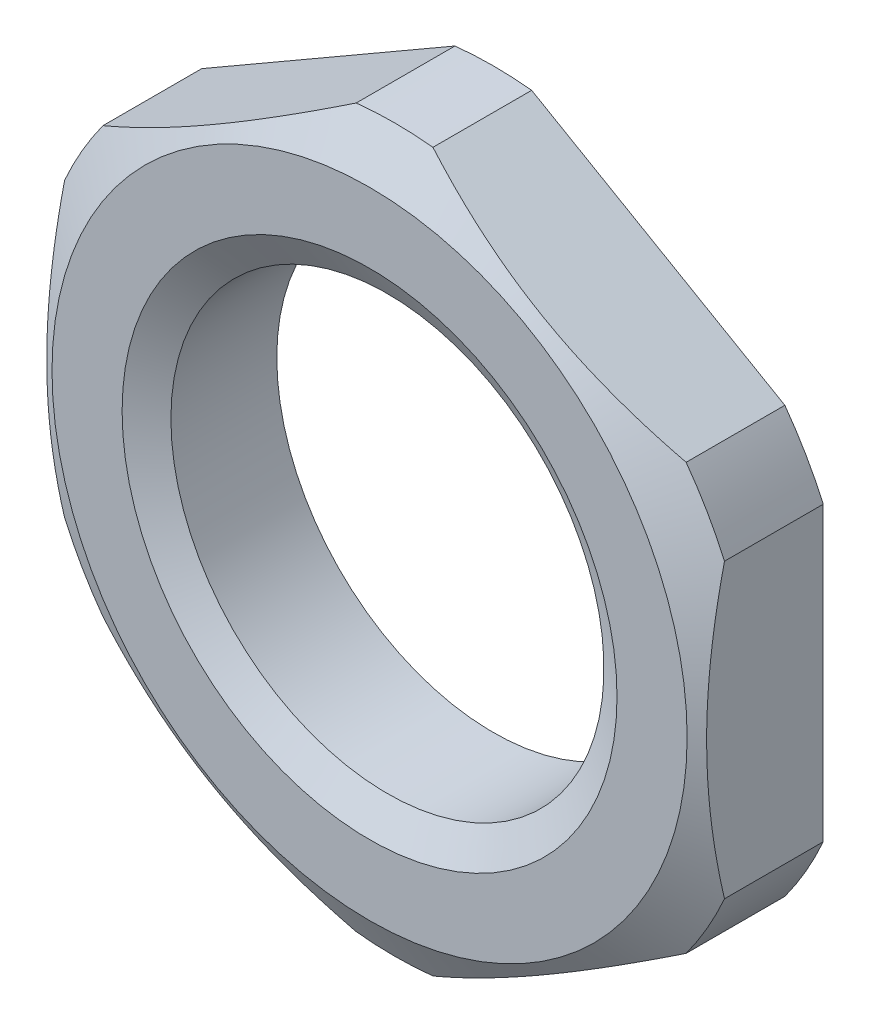
ISO-10303-21;
HEADER;
FILE_DESCRIPTION(('STEP AP214'),'2;1');
FILE_NAME('part.step','',(''),(''),'','','');
FILE_SCHEMA(('AUTOMOTIVE_DESIGN { 1 0 10303 214 1 1 1 1 }'));
ENDSEC;
DATA;
#1=APPLICATION_CONTEXT('core data for automotive mechanical design processes');
#2=APPLICATION_PROTOCOL_DEFINITION('international standard','automotive_design',2000,#1);
#3=PRODUCT_CONTEXT('',#1,'mechanical');
#4=PRODUCT('Part','Part','',(#3));
#5=PRODUCT_RELATED_PRODUCT_CATEGORY('part','',(#4));
#6=PRODUCT_DEFINITION_FORMATION('','',#4);
#7=PRODUCT_DEFINITION_CONTEXT('part definition',#1,'design');
#8=PRODUCT_DEFINITION('design','',#6,#7);
#9=PRODUCT_DEFINITION_SHAPE('','',#8);
#10=(LENGTH_UNIT() NAMED_UNIT(*) SI_UNIT(.MILLI.,.METRE.));
#11=(NAMED_UNIT(*) PLANE_ANGLE_UNIT() SI_UNIT($,.RADIAN.));
#12=(NAMED_UNIT(*) SI_UNIT($,.STERADIAN.) SOLID_ANGLE_UNIT());
#13=UNCERTAINTY_MEASURE_WITH_UNIT(LENGTH_MEASURE(1.E-05),#10,'distance_accuracy_value','');
#14=(GEOMETRIC_REPRESENTATION_CONTEXT(3) GLOBAL_UNCERTAINTY_ASSIGNED_CONTEXT((#13)) GLOBAL_UNIT_ASSIGNED_CONTEXT((#10,
#11,#12)) REPRESENTATION_CONTEXT('',''));
#15=CARTESIAN_POINT('',(0.,0.,0.));
#16=DIRECTION('',(0.,0.,1.));
#17=DIRECTION('',(1.,0.,0.));
#18=AXIS2_PLACEMENT_3D('',#15,#16,#17);
#19=CARTESIAN_POINT('',(0.,0.,0.));
#20=DIRECTION('',(0.,0.,-1.));
#21=DIRECTION('',(-1.,0.,0.));
#22=AXIS2_PLACEMENT_3D('',#19,#20,#21);
#23=CONICAL_SURFACE('',#22,7.7,1.0471975511966);
#24=CARTESIAN_POINT('',(0.,0.,-0.606217782649107));
#25=DIRECTION('',(0.,0.,-1.));
#26=DIRECTION('',(-1.,0.,0.));
#27=AXIS2_PLACEMENT_3D('',#24,#25,#26);
#28=CIRCLE('',#27,8.75);
#29=CARTESIAN_POINT('',(-0.930492710547831,8.70038409012024,-0.606217782649107));
#30=VERTEX_POINT('',#29);
#31=CARTESIAN_POINT('',(0.930492710547825,8.70038409012024,-0.606217782649107));
#32=VERTEX_POINT('',#31);
#33=EDGE_CURVE('E143',#30,#32,#28,.T.);
#34=ORIENTED_EDGE('',*,*,#33,.F.);
#35=CARTESIAN_POINT('',(-7.07024782767937,5.15559482048597,-0.606417782649106));
#36=CARTESIAN_POINT('',(-6.90148087906585,5.25303246369829,-0.560827597447312));
#37=CARTESIAN_POINT('',(-6.73208945777638,5.35083064637818,-0.518221370815185));
#38=CARTESIAN_POINT('',(-6.39211380389606,5.5471156816639,-0.439610585245916));
#39=CARTESIAN_POINT('',(-6.22152924144576,5.64560272471418,-0.403607933420928));
#40=CARTESIAN_POINT('',(-5.87914841907391,5.84327638467593,-0.33883245483654));
#41=CARTESIAN_POINT('',(-5.70735111111037,5.94246360667473,-0.310066952118132));
#42=CARTESIAN_POINT('',(-5.36291860488582,6.14132180686113,-0.260393822837285));
#43=CARTESIAN_POINT('',(-5.19028349106087,6.24099273629955,-0.239485420418063));
#44=CARTESIAN_POINT('',(-4.84766165540015,6.43880554534851,-0.206300910486343));
#45=CARTESIAN_POINT('',(-4.67768626969476,6.53694088004113,-0.193869681917507));
#46=CARTESIAN_POINT('',(-4.33743333679985,6.73338600244056,-0.177296510459336));
#47=CARTESIAN_POINT('',(-4.16715579495013,6.83169578706445,-0.173154422513488));
#48=CARTESIAN_POINT('',(-3.82672126187345,7.02824575637771,-0.173256640546117));
#49=CARTESIAN_POINT('',(-3.65656426928932,7.12648594185066,-0.177495107222737));
#50=CARTESIAN_POINT('',(-3.31657122626224,7.32278101676494,-0.194246464062967));
#51=CARTESIAN_POINT('',(-3.14673515244742,7.42083591970004,-0.206758726380949));
#52=CARTESIAN_POINT('',(-2.80564033024968,7.61776710711509,-0.239968908160903));
#53=CARTESIAN_POINT('',(-2.63438858443956,7.71663934865776,-0.260762108417526));
#54=CARTESIAN_POINT('',(-2.29272113587679,7.9139011420588,-0.310076759204187));
#55=CARTESIAN_POINT('',(-2.12230546023987,8.01229067826191,-0.338598458722785));
#56=CARTESIAN_POINT('',(-1.7808221079298,8.20944618364191,-0.4031222931993));
#57=CARTESIAN_POINT('',(-1.60976457436446,8.30820629669277,-0.439195422838334));
#58=CARTESIAN_POINT('',(-1.26884621332733,8.50503560420924,-0.517985988220957));
#59=CARTESIAN_POINT('',(-1.09898507401219,8.60310497871769,-0.560701620112898));
#60=CARTESIAN_POINT('',(-0.929752172319219,8.70081164006587,-0.606417782649489));
#61=B_SPLINE_CURVE_WITH_KNOTS('',3,(#35,#36,#37,#38,#39,#40,#41,#42,#43,#44,#45,#46,#47,#48,#49,
#50,#51,#52,#53,#54,#55,#56,#57,#58,#59,#60),.UNSPECIFIED.,.F.,.F.,(4,2,2,2,2,2,2,2,2,2,2,2,4),
(0.,0.600421078435158,1.20101528636273,1.80221487650076,2.40335508500863,2.99317671131804,
3.58298801590404,4.17238850369464,4.76174427076978,5.35808672461223,5.9544483930656,
6.55669108892153,7.15877052319375),.UNSPECIFIED.);
#62=CARTESIAN_POINT('',(-7.06950728945217,5.15602237043078,-0.606217782649107));
#63=VERTEX_POINT('',#62);
#64=EDGE_CURVE('E166',#63,#30,#61,.T.);
#65=ORIENTED_EDGE('',*,*,#64,.F.);
#66=CARTESIAN_POINT('',(-8.,3.54436171968946,-0.606217782649106));
#67=VERTEX_POINT('',#66);
#68=EDGE_CURVE('E141',#67,#63,#28,.T.);
#69=ORIENTED_EDGE('',*,*,#68,.F.);
#70=CARTESIAN_POINT('',(-8.,-13.8764766111287,-4.80204412448945));
#71=CARTESIAN_POINT('',(-8.,-13.5442874801191,-4.63591549315543));
#72=CARTESIAN_POINT('',(-8.,-13.2115180857593,-4.47093495417548));
#73=CARTESIAN_POINT('',(-8.,-12.5445543586188,-4.14382481794102));
#74=CARTESIAN_POINT('',(-8.,-12.2103599319763,-3.98169541220027));
#75=CARTESIAN_POINT('',(-8.,-11.5396499896447,-3.6605409337019));
#76=CARTESIAN_POINT('',(-8.,-11.2031311507491,-3.50152278649282));
#77=CARTESIAN_POINT('',(-8.,-10.5281391364751,-3.1876992829647));
#78=CARTESIAN_POINT('',(-8.,-10.1896659995691,-3.03289384405452));
#79=CARTESIAN_POINT('',(-8.,-9.49513378913338,-2.72163092055866));
#80=CARTESIAN_POINT('',(-8.,-9.13896765926432,-2.56541152721838));
#81=CARTESIAN_POINT('',(-8.,-8.42356960277638,-2.26008385836664));
#82=CARTESIAN_POINT('',(-8.,-8.06433753997261,-2.11097590069477));
#83=CARTESIAN_POINT('',(-8.,-7.34245687310797,-1.82188695772267));
#84=CARTESIAN_POINT('',(-8.,-6.97981053398933,-1.68190035111402));
#85=CARTESIAN_POINT('',(-8.,-6.25027969427314,-1.41349922902));
#86=CARTESIAN_POINT('',(-8.,-5.88339566322241,-1.28508344507549));
#87=CARTESIAN_POINT('',(-8.,-5.05797946165013,-1.01461876111247));
#88=CARTESIAN_POINT('',(-8.,-4.59815647589117,-0.876449351736542));
#89=CARTESIAN_POINT('',(-8.,-3.67022179574602,-0.630530687581275));
#90=CARTESIAN_POINT('',(-8.,-3.20211085723131,-0.522778673730966));
#91=CARTESIAN_POINT('',(-8.,-2.49841127585198,-0.391544954818452));
#92=CARTESIAN_POINT('',(-8.,-2.26559305282137,-0.353070102390249));
#93=CARTESIAN_POINT('',(-8.,-1.79843934275616,-0.286674133852241));
#94=CARTESIAN_POINT('',(-8.,-1.56410388226326,-0.258752833629062));
#95=CARTESIAN_POINT('',(-8.,-1.09442904610587,-0.214307703620745));
#96=CARTESIAN_POINT('',(-8.,-0.859090051533899,-0.197779878244263));
#97=CARTESIAN_POINT('',(-8.,-0.387872475907795,-0.176641903679802));
#98=CARTESIAN_POINT('',(-8.,-0.151993897100356,-0.172031704959875));
#99=CARTESIAN_POINT('',(-8.,0.321094555455518,-0.174894323794021));
#100=CARTESIAN_POINT('',(-8.,0.55830399113351,-0.182439269048492));
#101=CARTESIAN_POINT('',(-8.,1.03203312581689,-0.209490559349325));
#102=CARTESIAN_POINT('',(-8.,1.26855282175315,-0.228996957539015));
#103=CARTESIAN_POINT('',(-8.,1.74046266183219,-0.279350980375523));
#104=CARTESIAN_POINT('',(-8.,1.97585234427651,-0.310202897294681));
#105=CARTESIAN_POINT('',(-8.,2.44501424995313,-0.382340249104343));
#106=CARTESIAN_POINT('',(-8.,2.67878641627033,-0.423626049230286));
#107=CARTESIAN_POINT('',(-8.,3.38515478124549,-0.563105940856547));
#108=CARTESIAN_POINT('',(-8.,3.85486745607192,-0.676015200681886));
#109=CARTESIAN_POINT('',(-8.,4.7861771729947,-0.931483455454732));
#110=CARTESIAN_POINT('',(-8.,5.24776950158325,-1.0740590921215));
#111=CARTESIAN_POINT('',(-8.,6.06591729060817,-1.34835302184172));
#112=CARTESIAN_POINT('',(-8.,6.42388951791318,-1.47590773769571));
#113=CARTESIAN_POINT('',(-8.,7.13574301584211,-1.7416227189199));
#114=CARTESIAN_POINT('',(-8.,7.48962538091356,-1.87978006769539));
#115=CARTESIAN_POINT('',(-8.,8.19422740347913,-2.16454843047428));
#116=CARTESIAN_POINT('',(-8.,8.54494479460472,-2.31116502025219));
#117=CARTESIAN_POINT('',(-8.,9.24354242340729,-2.61104347450411));
#118=CARTESIAN_POINT('',(-8.,9.59142248377611,-2.76430575055151));
#119=CARTESIAN_POINT('',(-8.,10.2701619396937,-3.06956319456063));
#120=CARTESIAN_POINT('',(-8.,10.601120267001,-3.22133906763949));
#121=CARTESIAN_POINT('',(-8.,11.2611758690625,-3.52886476718296));
#122=CARTESIAN_POINT('',(-8.,11.5902731725835,-3.68461453201461));
#123=CARTESIAN_POINT('',(-8.,12.2463188455876,-3.99910327985798));
#124=CARTESIAN_POINT('',(-8.,12.5732699832054,-4.15783649998909));
#125=CARTESIAN_POINT('',(-8.,13.2258250119478,-4.47802750792386));
#126=CARTESIAN_POINT('',(-8.,13.551428940302,-4.63948521980248));
#127=CARTESIAN_POINT('',(-8.,13.8764766111287,-4.80204412448945));
#128=B_SPLINE_CURVE_WITH_KNOTS('',3,(#70,#71,#72,#73,#74,#75,#76,#77,#78,#79,#80,#81,#82,#83,
#84,#85,#86,#87,#88,#89,#90,#91,#92,#93,#94,#95,#96,#97,#98,#99,#100,#101,#102,#103,#104,#105,
#106,#107,#108,#109,#110,#111,#112,#113,#114,#115,#116,#117,#118,#119,#120,#121,#122,#123,#124,
#125,#126,#127),.UNSPECIFIED.,.F.,.F.,(4,2,2,2,2,2,2,2,2,2,2,2,2,2,2,2,2,2,2,2,2,2,2,2,2,2,2,2,
4),(0.,1.11424782953866,2.22857022062478,3.34514153993561,4.46169095280487,5.62838972754018,
6.79514059811683,7.96116548618538,9.12706239208431,10.5667331388362,12.0062732553686,
12.7139993204113,13.4217130381564,14.1291784404967,14.83664090247,15.5483168776021,
16.2599960146498,16.9719446738461,17.6839182580777,19.1317483219491,20.5803927641636,
21.7202530681177,22.8598009331284,24.0001086897723,25.1404871678566,26.2327581696164,
27.3250122411137,28.4153379548907,29.5056333339285),.UNSPECIFIED.);
#129=CARTESIAN_POINT('',(-8.,-3.54436171968946,-0.606217782649107));
#130=VERTEX_POINT('',#129);
#131=EDGE_CURVE('E169',#130,#67,#128,.T.);
#132=ORIENTED_EDGE('',*,*,#131,.F.);
#133=CARTESIAN_POINT('',(-7.06950728945217,-5.15602237043078,-0.606217782649107));
#134=VERTEX_POINT('',#133);
#135=EDGE_CURVE('E261',#134,#130,#28,.T.);
#136=ORIENTED_EDGE('',*,*,#135,.F.);
#137=CARTESIAN_POINT('',(-0.929752172319214,-8.70081164006587,-0.60641778264949));
#138=CARTESIAN_POINT('',(-1.09851912093274,-8.60337399685355,-0.560827597447674));
#139=CARTESIAN_POINT('',(-1.26791054222222,-8.50557581417365,-0.518221370815527));
#140=CARTESIAN_POINT('',(-1.60788619610256,-8.30929077888792,-0.439610585246217));
#141=CARTESIAN_POINT('',(-1.77847075855287,-8.21080373583763,-0.403607933421208));
#142=CARTESIAN_POINT('',(-2.12085158092473,-8.01313007587588,-0.338832454836777));
#143=CARTESIAN_POINT('',(-2.29264888888829,-7.91394285387706,-0.310066952118347));
#144=CARTESIAN_POINT('',(-2.63708139511286,-7.71508465369065,-0.260393822837454));
#145=CARTESIAN_POINT('',(-2.80971650893782,-7.61541372425223,-0.23948542041821));
#146=CARTESIAN_POINT('',(-3.15233834459857,-7.41760091520325,-0.206300910486446));
#147=CARTESIAN_POINT('',(-3.32231373030396,-7.31946558051063,-0.193869681917589));
#148=CARTESIAN_POINT('',(-3.66256666319889,-7.12302045811118,-0.177296510459376));
#149=CARTESIAN_POINT('',(-3.83284420504863,-7.02471067348729,-0.173154422513506));
#150=CARTESIAN_POINT('',(-4.17327873812534,-6.82816070417401,-0.173256640546096));
#151=CARTESIAN_POINT('',(-4.34343573070947,-6.72992051870106,-0.177495107222697));
#152=CARTESIAN_POINT('',(-4.68342877373658,-6.53362544378676,-0.19424646406289));
#153=CARTESIAN_POINT('',(-4.85326484755141,-6.43557054085166,-0.206758726380853));
#154=CARTESIAN_POINT('',(-5.19435966974915,-6.23863935343661,-0.23996890816077));
#155=CARTESIAN_POINT('',(-5.36561141555924,-6.13976711189396,-0.260762108417371));
#156=CARTESIAN_POINT('',(-5.70727886412197,-5.94250531849293,-0.310076759203989));
#157=CARTESIAN_POINT('',(-5.87769453975886,-5.84411578228984,-0.338598458722565));
#158=CARTESIAN_POINT('',(-6.21917789206889,-5.64696027690987,-0.403122293199035));
#159=CARTESIAN_POINT('',(-6.39023542563421,-5.54820016385902,-0.439195422838046));
#160=CARTESIAN_POINT('',(-6.73115378667129,-5.35137085634257,-0.517985988220622));
#161=CARTESIAN_POINT('',(-6.90101492598641,-5.25330148183413,-0.56070162011254));
#162=CARTESIAN_POINT('',(-7.07024782767936,-5.15559482048597,-0.606417782649106));
#163=B_SPLINE_CURVE_WITH_KNOTS('',3,(#137,#138,#139,#140,#141,#142,#143,#144,#145,#146,#147,
#148,#149,#150,#151,#152,#153,#154,#155,#156,#157,#158,#159,#160,#161,#162),.UNSPECIFIED.,.F.,
.F.,(4,2,2,2,2,2,2,2,2,2,2,2,4),(0.,0.600421078435202,1.20101528636281,1.8022148765009,
2.40335508500881,2.99317671131826,3.58298801590431,4.17238850369495,4.76174427077013,
5.3580867246125,5.95444839306578,6.55669108892162,7.15877052319376),.UNSPECIFIED.);
#164=CARTESIAN_POINT('',(-0.930492710547825,-8.70038409012024,-0.606217782649107));
#165=VERTEX_POINT('',#164);
#166=EDGE_CURVE('E127',#165,#134,#163,.T.);
#167=ORIENTED_EDGE('',*,*,#166,.F.);
#168=CARTESIAN_POINT('',(0.930492710547831,-8.70038409012024,-0.606217782649107));
#169=VERTEX_POINT('',#168);
#170=EDGE_CURVE('E126',#169,#165,#28,.T.);
#171=ORIENTED_EDGE('',*,*,#170,.F.);
#172=CARTESIAN_POINT('',(7.07024782767937,-5.15559482048597,-0.606417782649106));
#173=CARTESIAN_POINT('',(6.90148087906585,-5.25303246369829,-0.560827597447312));
#174=CARTESIAN_POINT('',(6.73208945777638,-5.35083064637818,-0.518221370815185));
#175=CARTESIAN_POINT('',(6.39211380389606,-5.5471156816639,-0.439610585245916));
#176=CARTESIAN_POINT('',(6.22152924144576,-5.64560272471418,-0.403607933420928));
#177=CARTESIAN_POINT('',(5.87914841907391,-5.84327638467593,-0.33883245483654));
#178=CARTESIAN_POINT('',(5.70735111111037,-5.94246360667473,-0.310066952118132));
#179=CARTESIAN_POINT('',(5.36291860488582,-6.14132180686113,-0.260393822837285));
#180=CARTESIAN_POINT('',(5.19028349106087,-6.24099273629955,-0.239485420418063));
#181=CARTESIAN_POINT('',(4.84766165540015,-6.43880554534851,-0.206300910486343));
#182=CARTESIAN_POINT('',(4.67768626969476,-6.53694088004113,-0.193869681917507));
#183=CARTESIAN_POINT('',(4.33743333679985,-6.73338600244056,-0.177296510459336));
#184=CARTESIAN_POINT('',(4.16715579495013,-6.83169578706445,-0.173154422513488));
#185=CARTESIAN_POINT('',(3.82672126187345,-7.02824575637771,-0.173256640546117));
#186=CARTESIAN_POINT('',(3.65656426928932,-7.12648594185066,-0.177495107222737));
#187=CARTESIAN_POINT('',(3.31657122626224,-7.32278101676494,-0.194246464062967));
#188=CARTESIAN_POINT('',(3.14673515244742,-7.42083591970004,-0.206758726380949));
#189=CARTESIAN_POINT('',(2.80564033024968,-7.61776710711509,-0.239968908160903));
#190=CARTESIAN_POINT('',(2.63438858443956,-7.71663934865776,-0.260762108417526));
#191=CARTESIAN_POINT('',(2.29272113587679,-7.9139011420588,-0.310076759204187));
#192=CARTESIAN_POINT('',(2.12230546023987,-8.01229067826191,-0.338598458722785));
#193=CARTESIAN_POINT('',(1.7808221079298,-8.20944618364191,-0.4031222931993));
#194=CARTESIAN_POINT('',(1.60976457436446,-8.30820629669277,-0.439195422838334));
#195=CARTESIAN_POINT('',(1.26884621332733,-8.50503560420924,-0.517985988220957));
#196=CARTESIAN_POINT('',(1.09898507401219,-8.60310497871769,-0.560701620112898));
#197=CARTESIAN_POINT('',(0.929752172319219,-8.70081164006587,-0.606417782649489));
#198=B_SPLINE_CURVE_WITH_KNOTS('',3,(#172,#173,#174,#175,#176,#177,#178,#179,#180,#181,#182,
#183,#184,#185,#186,#187,#188,#189,#190,#191,#192,#193,#194,#195,#196,#197),.UNSPECIFIED.,.F.,
.F.,(4,2,2,2,2,2,2,2,2,2,2,2,4),(0.,0.600421078435158,1.20101528636273,1.80221487650076,
2.40335508500863,2.99317671131804,3.58298801590404,4.17238850369464,4.76174427076978,
5.35808672461223,5.9544483930656,6.55669108892153,7.15877052319375),.UNSPECIFIED.);
#199=CARTESIAN_POINT('',(7.06950728945217,-5.15602237043078,-0.606217782649107));
#200=VERTEX_POINT('',#199);
#201=EDGE_CURVE('E232',#200,#169,#198,.T.);
#202=ORIENTED_EDGE('',*,*,#201,.F.);
#203=CARTESIAN_POINT('',(8.,-3.54436171968946,-0.606217782649106));
#204=VERTEX_POINT('',#203);
#205=EDGE_CURVE('E256',#204,#200,#28,.T.);
#206=ORIENTED_EDGE('',*,*,#205,.F.);
#207=CARTESIAN_POINT('',(8.,13.8764766111287,-4.80204412448945));
#208=CARTESIAN_POINT('',(8.,13.5442874801191,-4.63591549315543));
#209=CARTESIAN_POINT('',(8.,13.2115180857593,-4.47093495417548));
#210=CARTESIAN_POINT('',(8.,12.5445543586188,-4.14382481794102));
#211=CARTESIAN_POINT('',(8.,12.2103599319763,-3.98169541220027));
#212=CARTESIAN_POINT('',(8.,11.5396499896447,-3.6605409337019));
#213=CARTESIAN_POINT('',(8.,11.2031311507491,-3.50152278649282));
#214=CARTESIAN_POINT('',(8.,10.5281391364751,-3.1876992829647));
#215=CARTESIAN_POINT('',(8.,10.1896659995691,-3.03289384405452));
#216=CARTESIAN_POINT('',(8.,9.49513378913338,-2.72163092055866));
#217=CARTESIAN_POINT('',(8.,9.13896765926432,-2.56541152721838));
#218=CARTESIAN_POINT('',(8.,8.42356960277638,-2.26008385836664));
#219=CARTESIAN_POINT('',(8.,8.06433753997261,-2.11097590069477));
#220=CARTESIAN_POINT('',(8.,7.34245687310797,-1.82188695772267));
#221=CARTESIAN_POINT('',(8.,6.97981053398933,-1.68190035111402));
#222=CARTESIAN_POINT('',(8.,6.25027969427314,-1.41349922902));
#223=CARTESIAN_POINT('',(8.,5.88339566322241,-1.28508344507549));
#224=CARTESIAN_POINT('',(8.,5.05797946165013,-1.01461876111247));
#225=CARTESIAN_POINT('',(8.,4.59815647589117,-0.876449351736542));
#226=CARTESIAN_POINT('',(8.,3.67022179574602,-0.630530687581275));
#227=CARTESIAN_POINT('',(8.,3.20211085723131,-0.522778673730966));
#228=CARTESIAN_POINT('',(8.,2.49841127585198,-0.391544954818452));
#229=CARTESIAN_POINT('',(8.,2.26559305282137,-0.353070102390249));
#230=CARTESIAN_POINT('',(8.,1.79843934275616,-0.286674133852241));
#231=CARTESIAN_POINT('',(8.,1.56410388226326,-0.258752833629062));
#232=CARTESIAN_POINT('',(8.,1.09442904610587,-0.214307703620745));
#233=CARTESIAN_POINT('',(8.,0.859090051533899,-0.197779878244263));
#234=CARTESIAN_POINT('',(8.,0.387872475907795,-0.176641903679802));
#235=CARTESIAN_POINT('',(8.,0.151993897100356,-0.172031704959875));
#236=CARTESIAN_POINT('',(8.,-0.321094555455518,-0.174894323794021));
#237=CARTESIAN_POINT('',(8.,-0.55830399113351,-0.182439269048492));
#238=CARTESIAN_POINT('',(8.,-1.03203312581689,-0.209490559349325));
#239=CARTESIAN_POINT('',(8.,-1.26855282175315,-0.228996957539015));
#240=CARTESIAN_POINT('',(8.,-1.74046266183219,-0.279350980375523));
#241=CARTESIAN_POINT('',(8.,-1.97585234427651,-0.310202897294681));
#242=CARTESIAN_POINT('',(8.,-2.44501424995313,-0.382340249104343));
#243=CARTESIAN_POINT('',(8.,-2.67878641627033,-0.423626049230286));
#244=CARTESIAN_POINT('',(8.,-3.38515478124549,-0.563105940856547));
#245=CARTESIAN_POINT('',(8.,-3.85486745607192,-0.676015200681886));
#246=CARTESIAN_POINT('',(8.,-4.7861771729947,-0.931483455454732));
#247=CARTESIAN_POINT('',(8.,-5.24776950158325,-1.0740590921215));
#248=CARTESIAN_POINT('',(8.,-6.06591729060817,-1.34835302184172));
#249=CARTESIAN_POINT('',(8.,-6.42388951791318,-1.47590773769571));
#250=CARTESIAN_POINT('',(8.,-7.13574301584211,-1.7416227189199));
#251=CARTESIAN_POINT('',(8.,-7.48962538091356,-1.87978006769539));
#252=CARTESIAN_POINT('',(8.,-8.19422740347913,-2.16454843047428));
#253=CARTESIAN_POINT('',(8.,-8.54494479460472,-2.31116502025219));
#254=CARTESIAN_POINT('',(8.,-9.24354242340729,-2.61104347450411));
#255=CARTESIAN_POINT('',(8.,-9.59142248377611,-2.76430575055151));
#256=CARTESIAN_POINT('',(8.,-10.2701619396937,-3.06956319456063));
#257=CARTESIAN_POINT('',(8.,-10.601120267001,-3.22133906763949));
#258=CARTESIAN_POINT('',(8.,-11.2611758690625,-3.52886476718296));
#259=CARTESIAN_POINT('',(8.,-11.5902731725835,-3.68461453201461));
#260=CARTESIAN_POINT('',(8.,-12.2463188455876,-3.99910327985798));
#261=CARTESIAN_POINT('',(8.,-12.5732699832054,-4.15783649998909));
#262=CARTESIAN_POINT('',(8.,-13.2258250119478,-4.47802750792386));
#263=CARTESIAN_POINT('',(8.,-13.551428940302,-4.63948521980248));
#264=CARTESIAN_POINT('',(8.,-13.8764766111287,-4.80204412448945));
#265=B_SPLINE_CURVE_WITH_KNOTS('',3,(#207,#208,#209,#210,#211,#212,#213,#214,#215,#216,#217,
#218,#219,#220,#221,#222,#223,#224,#225,#226,#227,#228,#229,#230,#231,#232,#233,#234,#235,#236,
#237,#238,#239,#240,#241,#242,#243,#244,#245,#246,#247,#248,#249,#250,#251,#252,#253,#254,#255,
#256,#257,#258,#259,#260,#261,#262,#263,#264),.UNSPECIFIED.,.F.,.F.,(4,2,2,2,2,2,2,2,2,2,2,2,2,
2,2,2,2,2,2,2,2,2,2,2,2,2,2,2,4),(0.,1.11424782953866,2.22857022062478,3.34514153993561,
4.46169095280487,5.62838972754018,6.79514059811683,7.96116548618538,9.12706239208431,
10.5667331388362,12.0062732553686,12.7139993204113,13.4217130381564,14.1291784404967,
14.83664090247,15.5483168776021,16.2599960146498,16.9719446738461,17.6839182580777,
19.1317483219491,20.5803927641636,21.7202530681177,22.8598009331284,24.0001086897723,
25.1404871678566,26.2327581696164,27.3250122411137,28.4153379548907,29.5056333339285),.UNSPECIFIED.);
#266=CARTESIAN_POINT('',(8.,3.54436171968946,-0.606217782649107));
#267=VERTEX_POINT('',#266);
#268=EDGE_CURVE('E211',#267,#204,#265,.T.);
#269=ORIENTED_EDGE('',*,*,#268,.F.);
#270=CARTESIAN_POINT('',(7.06950728945217,5.15602237043078,-0.606217782649107));
#271=VERTEX_POINT('',#270);
#272=EDGE_CURVE('E146',#271,#267,#28,.T.);
#273=ORIENTED_EDGE('',*,*,#272,.F.);
#274=CARTESIAN_POINT('',(0.929752172319214,8.70081164006587,-0.60641778264949));
#275=CARTESIAN_POINT('',(1.09851912093274,8.60337399685355,-0.560827597447674));
#276=CARTESIAN_POINT('',(1.26791054222222,8.50557581417365,-0.518221370815527));
#277=CARTESIAN_POINT('',(1.60788619610256,8.30929077888792,-0.439610585246217));
#278=CARTESIAN_POINT('',(1.77847075855287,8.21080373583763,-0.403607933421208));
#279=CARTESIAN_POINT('',(2.12085158092473,8.01313007587588,-0.338832454836777));
#280=CARTESIAN_POINT('',(2.29264888888829,7.91394285387706,-0.310066952118347));
#281=CARTESIAN_POINT('',(2.63708139511286,7.71508465369065,-0.260393822837454));
#282=CARTESIAN_POINT('',(2.80971650893782,7.61541372425223,-0.23948542041821));
#283=CARTESIAN_POINT('',(3.15233834459857,7.41760091520325,-0.206300910486446));
#284=CARTESIAN_POINT('',(3.32231373030396,7.31946558051063,-0.193869681917589));
#285=CARTESIAN_POINT('',(3.66256666319889,7.12302045811118,-0.177296510459376));
#286=CARTESIAN_POINT('',(3.83284420504863,7.02471067348729,-0.173154422513506));
#287=CARTESIAN_POINT('',(4.17327873812534,6.82816070417401,-0.173256640546096));
#288=CARTESIAN_POINT('',(4.34343573070947,6.72992051870106,-0.177495107222697));
#289=CARTESIAN_POINT('',(4.68342877373658,6.53362544378676,-0.19424646406289));
#290=CARTESIAN_POINT('',(4.85326484755141,6.43557054085166,-0.206758726380853));
#291=CARTESIAN_POINT('',(5.19435966974915,6.23863935343661,-0.23996890816077));
#292=CARTESIAN_POINT('',(5.36561141555924,6.13976711189396,-0.260762108417371));
#293=CARTESIAN_POINT('',(5.70727886412197,5.94250531849293,-0.310076759203989));
#294=CARTESIAN_POINT('',(5.87769453975886,5.84411578228984,-0.338598458722565));
#295=CARTESIAN_POINT('',(6.21917789206889,5.64696027690987,-0.403122293199035));
#296=CARTESIAN_POINT('',(6.39023542563421,5.54820016385902,-0.439195422838046));
#297=CARTESIAN_POINT('',(6.73115378667129,5.35137085634257,-0.517985988220622));
#298=CARTESIAN_POINT('',(6.90101492598641,5.25330148183413,-0.56070162011254));
#299=CARTESIAN_POINT('',(7.07024782767936,5.15559482048597,-0.606417782649106));
#300=B_SPLINE_CURVE_WITH_KNOTS('',3,(#274,#275,#276,#277,#278,#279,#280,#281,#282,#283,#284,
#285,#286,#287,#288,#289,#290,#291,#292,#293,#294,#295,#296,#297,#298,#299),.UNSPECIFIED.,.F.,
.F.,(4,2,2,2,2,2,2,2,2,2,2,2,4),(0.,0.600421078435202,1.20101528636281,1.8022148765009,
2.40335508500881,2.99317671131826,3.58298801590431,4.17238850369495,4.76174427077013,
5.3580867246125,5.95444839306578,6.55669108892162,7.15877052319376),.UNSPECIFIED.);
#301=EDGE_CURVE('E201',#32,#271,#300,.T.);
#302=ORIENTED_EDGE('',*,*,#301,.F.);
#303=EDGE_LOOP('',(#34,#65,#69,#132,#136,#167,#171,#202,#206,#269,#273,#302));
#304=FACE_BOUND('',#303,.T.);
#305=CARTESIAN_POINT('',(0.,0.,0.));
#306=DIRECTION('',(0.,0.,-1.));
#307=DIRECTION('',(-1.,0.,0.));
#308=AXIS2_PLACEMENT_3D('',#305,#306,#307);
#309=CIRCLE('',#308,7.7);
#310=CARTESIAN_POINT('',(-7.7,0.,0.));
#311=VERTEX_POINT('',#310);
#312=EDGE_CURVE('E117',#311,#311,#309,.T.);
#313=ORIENTED_EDGE('',*,*,#312,.T.);
#314=EDGE_LOOP('',(#313));
#315=FACE_BOUND('',#314,.T.);
#316=ADVANCED_FACE('F16',(#304,#315),#23,.T.);
#317=CARTESIAN_POINT('',(0.,0.,-3.));
#318=DIRECTION('',(0.,0.,-1.));
#319=DIRECTION('',(-1.,0.,0.));
#320=AXIS2_PLACEMENT_3D('',#317,#318,#319);
#321=CYLINDRICAL_SURFACE('',#320,8.75);
#322=DIRECTION('',(0.,0.,-1.));
#323=VECTOR('',#322,1.);
#324=CARTESIAN_POINT('',(-8.,3.54436171968946,-3.));
#325=LINE('',#324,#323);
#326=CARTESIAN_POINT('',(-8.,3.54436171968946,-3.));
#327=VERTEX_POINT('',#326);
#328=EDGE_CURVE('E38',#67,#327,#325,.T.);
#329=ORIENTED_EDGE('',*,*,#328,.F.);
#330=ORIENTED_EDGE('',*,*,#68,.T.);
#331=DIRECTION('',(0.,0.,-1.));
#332=VECTOR('',#331,1.);
#333=CARTESIAN_POINT('',(-7.06950728945217,5.15602237043078,-3.));
#334=LINE('',#333,#332);
#335=CARTESIAN_POINT('',(-7.06950728945217,5.15602237043078,-3.));
#336=VERTEX_POINT('',#335);
#337=EDGE_CURVE('E157',#336,#63,#334,.F.);
#338=ORIENTED_EDGE('',*,*,#337,.F.);
#339=CARTESIAN_POINT('',(0.,0.,-3.));
#340=DIRECTION('',(0.,0.,-1.));
#341=DIRECTION('',(-1.,0.,0.));
#342=AXIS2_PLACEMENT_3D('',#339,#340,#341);
#343=CIRCLE('',#342,8.75);
#344=EDGE_CURVE('E138',#327,#336,#343,.T.);
#345=ORIENTED_EDGE('',*,*,#344,.F.);
#346=EDGE_LOOP('',(#329,#330,#338,#345));
#347=FACE_BOUND('',#346,.T.);
#348=ADVANCED_FACE('F164',(#347),#321,.T.);
#349=DIRECTION('',(0.,0.,-1.));
#350=VECTOR('',#349,1.);
#351=CARTESIAN_POINT('',(-8.,-3.54436171968946,-3.));
#352=LINE('',#351,#350);
#353=CARTESIAN_POINT('',(-8.,-3.54436171968946,-3.));
#354=VERTEX_POINT('',#353);
#355=EDGE_CURVE('E170',#354,#130,#352,.F.);
#356=ORIENTED_EDGE('',*,*,#355,.F.);
#357=CARTESIAN_POINT('',(-7.06950728945217,-5.15602237043078,-3.));
#358=VERTEX_POINT('',#357);
#359=EDGE_CURVE('E135',#358,#354,#343,.T.);
#360=ORIENTED_EDGE('',*,*,#359,.F.);
#361=DIRECTION('',(0.,0.,-1.));
#362=VECTOR('',#361,1.);
#363=CARTESIAN_POINT('',(-7.06950728945217,-5.15602237043078,-3.));
#364=LINE('',#363,#362);
#365=EDGE_CURVE('E111',#134,#358,#364,.T.);
#366=ORIENTED_EDGE('',*,*,#365,.F.);
#367=ORIENTED_EDGE('',*,*,#135,.T.);
#368=EDGE_LOOP('',(#356,#360,#366,#367));
#369=FACE_BOUND('',#368,.T.);
#370=ADVANCED_FACE('F266',(#369),#321,.T.);
#371=DIRECTION('',(0.,0.,-1.));
#372=VECTOR('',#371,1.);
#373=CARTESIAN_POINT('',(7.06950728945217,5.15602237043078,-3.));
#374=LINE('',#373,#372);
#375=CARTESIAN_POINT('',(7.06950728945217,5.15602237043078,-3.));
#376=VERTEX_POINT('',#375);
#377=EDGE_CURVE('E167',#271,#376,#374,.T.);
#378=ORIENTED_EDGE('',*,*,#377,.F.);
#379=ORIENTED_EDGE('',*,*,#272,.T.);
#380=DIRECTION('',(0.,0.,-1.));
#381=VECTOR('',#380,1.);
#382=CARTESIAN_POINT('',(8.,3.54436171968946,-3.));
#383=LINE('',#382,#381);
#384=CARTESIAN_POINT('',(8.,3.54436171968946,-3.));
#385=VERTEX_POINT('',#384);
#386=EDGE_CURVE('E217',#385,#267,#383,.F.);
#387=ORIENTED_EDGE('',*,*,#386,.F.);
#388=EDGE_CURVE('E137',#376,#385,#343,.T.);
#389=ORIENTED_EDGE('',*,*,#388,.F.);
#390=EDGE_LOOP('',(#378,#379,#387,#389));
#391=FACE_BOUND('',#390,.T.);
#392=ADVANCED_FACE('F258',(#391),#321,.T.);
#393=DIRECTION('',(0.,0.,-1.));
#394=VECTOR('',#393,1.);
#395=CARTESIAN_POINT('',(0.930492710547825,8.70038409012024,-3.));
#396=LINE('',#395,#394);
#397=CARTESIAN_POINT('',(0.93049271054783,8.70038409012024,-3.));
#398=VERTEX_POINT('',#397);
#399=EDGE_CURVE('E207',#398,#32,#396,.F.);
#400=ORIENTED_EDGE('',*,*,#399,.F.);
#401=CARTESIAN_POINT('',(-0.930492710547832,8.70038409012024,-3.));
#402=VERTEX_POINT('',#401);
#403=EDGE_CURVE('E31',#402,#398,#343,.T.);
#404=ORIENTED_EDGE('',*,*,#403,.F.);
#405=DIRECTION('',(0.,0.,-1.));
#406=VECTOR('',#405,1.);
#407=CARTESIAN_POINT('',(-0.930492710547825,8.70038409012024,-3.));
#408=LINE('',#407,#406);
#409=EDGE_CURVE('E159',#30,#402,#408,.T.);
#410=ORIENTED_EDGE('',*,*,#409,.F.);
#411=ORIENTED_EDGE('',*,*,#33,.T.);
#412=EDGE_LOOP('',(#400,#404,#410,#411));
#413=FACE_BOUND('',#412,.T.);
#414=ADVANCED_FACE('F267',(#413),#321,.T.);
#415=DIRECTION('',(0.,0.,-1.));
#416=VECTOR('',#415,1.);
#417=CARTESIAN_POINT('',(8.,-3.54436171968946,-3.));
#418=LINE('',#417,#416);
#419=CARTESIAN_POINT('',(8.,-3.54436171968946,-3.));
#420=VERTEX_POINT('',#419);
#421=EDGE_CURVE('E209',#204,#420,#418,.T.);
#422=ORIENTED_EDGE('',*,*,#421,.F.);
#423=ORIENTED_EDGE('',*,*,#205,.T.);
#424=DIRECTION('',(0.,0.,-1.));
#425=VECTOR('',#424,1.);
#426=CARTESIAN_POINT('',(7.06950728945217,-5.15602237043078,-3.));
#427=LINE('',#426,#425);
#428=CARTESIAN_POINT('',(7.06950728945217,-5.15602237043078,-3.));
#429=VERTEX_POINT('',#428);
#430=EDGE_CURVE('E239',#429,#200,#427,.F.);
#431=ORIENTED_EDGE('',*,*,#430,.F.);
#432=EDGE_CURVE('E134',#420,#429,#343,.T.);
#433=ORIENTED_EDGE('',*,*,#432,.F.);
#434=EDGE_LOOP('',(#422,#423,#431,#433));
#435=FACE_BOUND('',#434,.T.);
#436=ADVANCED_FACE('F282',(#435),#321,.T.);
#437=DIRECTION('',(0.,0.,-1.));
#438=VECTOR('',#437,1.);
#439=CARTESIAN_POINT('',(0.930492710547825,-8.70038409012024,-3.));
#440=LINE('',#439,#438);
#441=CARTESIAN_POINT('',(0.930492710547832,-8.70038409012024,-3.));
#442=VERTEX_POINT('',#441);
#443=EDGE_CURVE('E238',#169,#442,#440,.T.);
#444=ORIENTED_EDGE('',*,*,#443,.F.);
#445=ORIENTED_EDGE('',*,*,#170,.T.);
#446=DIRECTION('',(0.,0.,-1.));
#447=VECTOR('',#446,1.);
#448=CARTESIAN_POINT('',(-0.930492710547825,-8.70038409012024,-3.));
#449=LINE('',#448,#447);
#450=CARTESIAN_POINT('',(-0.930492710547827,-8.70038409012024,-3.));
#451=VERTEX_POINT('',#450);
#452=EDGE_CURVE('E108',#451,#165,#449,.F.);
#453=ORIENTED_EDGE('',*,*,#452,.F.);
#454=EDGE_CURVE('E124',#442,#451,#343,.T.);
#455=ORIENTED_EDGE('',*,*,#454,.F.);
#456=EDGE_LOOP('',(#444,#445,#453,#455));
#457=FACE_BOUND('',#456,.T.);
#458=ADVANCED_FACE('F123',(#457),#321,.T.);
#459=CARTESIAN_POINT('',(0.,8.75,-3.));
#460=DIRECTION('',(0.,0.,1.));
#461=DIRECTION('',(1.,0.,0.));
#462=AXIS2_PLACEMENT_3D('',#459,#460,#461);
#463=PLANE('',#462);
#464=CARTESIAN_POINT('',(0.,0.,-3.));
#465=DIRECTION('',(0.,0.,-1.));
#466=DIRECTION('',(-1.,0.,0.));
#467=AXIS2_PLACEMENT_3D('',#464,#465,#466);
#468=CIRCLE('',#467,5.25);
#469=CARTESIAN_POINT('',(-5.25,0.,-3.));
#470=VERTEX_POINT('',#469);
#471=EDGE_CURVE('E303',#470,#470,#468,.T.);
#472=ORIENTED_EDGE('',*,*,#471,.F.);
#473=EDGE_LOOP('',(#472));
#474=FACE_BOUND('',#473,.T.);
#475=DIRECTION('',(-0.866025403784439,-0.5,0.));
#476=VECTOR('',#475,1.);
#477=CARTESIAN_POINT('',(-0.211138858443081,9.11570323027551,-3.));
#478=LINE('',#477,#476);
#479=EDGE_CURVE('E24',#402,#336,#478,.T.);
#480=ORIENTED_EDGE('',*,*,#479,.F.);
#481=ORIENTED_EDGE('',*,*,#403,.T.);
#482=DIRECTION('',(-0.866025403784439,0.5,0.));
#483=VECTOR('',#482,1.);
#484=CARTESIAN_POINT('',(0.21113885844308,9.11570323027551,-3.));
#485=LINE('',#484,#483);
#486=EDGE_CURVE('E152',#376,#398,#485,.T.);
#487=ORIENTED_EDGE('',*,*,#486,.F.);
#488=ORIENTED_EDGE('',*,*,#388,.T.);
#489=DIRECTION('',(0.,1.,0.));
#490=VECTOR('',#489,1.);
#491=CARTESIAN_POINT('',(8.,8.75,-3.));
#492=LINE('',#491,#490);
#493=EDGE_CURVE('E150',#420,#385,#492,.T.);
#494=ORIENTED_EDGE('',*,*,#493,.F.);
#495=ORIENTED_EDGE('',*,*,#432,.T.);
#496=DIRECTION('',(0.866025403784439,0.5,0.));
#497=VECTOR('',#496,1.);
#498=CARTESIAN_POINT('',(7.78886114155692,-4.74070323027551,-3.));
#499=LINE('',#498,#497);
#500=EDGE_CURVE('E116',#442,#429,#499,.T.);
#501=ORIENTED_EDGE('',*,*,#500,.F.);
#502=ORIENTED_EDGE('',*,*,#454,.T.);
#503=DIRECTION('',(0.866025403784439,-0.5,0.));
#504=VECTOR('',#503,1.);
#505=CARTESIAN_POINT('',(-7.78886114155692,-4.74070323027551,-3.));
#506=LINE('',#505,#504);
#507=EDGE_CURVE('E105',#358,#451,#506,.T.);
#508=ORIENTED_EDGE('',*,*,#507,.F.);
#509=ORIENTED_EDGE('',*,*,#359,.T.);
#510=DIRECTION('',(0.,-1.,0.));
#511=VECTOR('',#510,1.);
#512=CARTESIAN_POINT('',(-8.,8.75,-3.));
#513=LINE('',#512,#511);
#514=EDGE_CURVE('E10',#327,#354,#513,.T.);
#515=ORIENTED_EDGE('',*,*,#514,.F.);
#516=ORIENTED_EDGE('',*,*,#344,.T.);
#517=EDGE_LOOP('',(#480,#481,#487,#488,#494,#495,#501,#502,#508,#509,#515,#516));
#518=FACE_BOUND('',#517,.T.);
#519=ADVANCED_FACE('F132',(#474,#518),#463,.F.);
#520=CARTESIAN_POINT('',(0.,0.,0.));
#521=DIRECTION('',(0.,0.,-1.));
#522=DIRECTION('',(-1.,0.,0.));
#523=AXIS2_PLACEMENT_3D('',#520,#521,#522);
#524=PLANE('',#523);
#525=ORIENTED_EDGE('',*,*,#312,.F.);
#526=EDGE_LOOP('',(#525));
#527=FACE_BOUND('',#526,.T.);
#528=CARTESIAN_POINT('',(0.,0.,0.));
#529=DIRECTION('',(0.,0.,-1.));
#530=DIRECTION('',(-1.,0.,0.));
#531=AXIS2_PLACEMENT_3D('',#528,#529,#530);
#532=CIRCLE('',#531,6.);
#533=CARTESIAN_POINT('',(-6.,0.,0.));
#534=VERTEX_POINT('',#533);
#535=EDGE_CURVE('E128',#534,#534,#532,.T.);
#536=ORIENTED_EDGE('',*,*,#535,.T.);
#537=EDGE_LOOP('',(#536));
#538=FACE_BOUND('',#537,.T.);
#539=ADVANCED_FACE('F18',(#527,#538),#524,.F.);
#540=CARTESIAN_POINT('',(-8.,-4.61880215351701,-3.));
#541=DIRECTION('',(-0.5,-0.866025403784439,0.));
#542=DIRECTION('',(0.866025403784439,-0.5,0.));
#543=AXIS2_PLACEMENT_3D('',#540,#541,#542);
#544=PLANE('',#543);
#545=ORIENTED_EDGE('',*,*,#365,.T.);
#546=ORIENTED_EDGE('',*,*,#507,.T.);
#547=ORIENTED_EDGE('',*,*,#452,.T.);
#548=ORIENTED_EDGE('',*,*,#166,.T.);
#549=EDGE_LOOP('',(#545,#546,#547,#548));
#550=FACE_BOUND('',#549,.T.);
#551=ADVANCED_FACE('F107',(#550),#544,.T.);
#552=CARTESIAN_POINT('',(0.,-9.23760430703401,-3.));
#553=DIRECTION('',(0.5,-0.866025403784439,0.));
#554=DIRECTION('',(0.866025403784439,0.5,0.));
#555=AXIS2_PLACEMENT_3D('',#552,#553,#554);
#556=PLANE('',#555);
#557=ORIENTED_EDGE('',*,*,#443,.T.);
#558=ORIENTED_EDGE('',*,*,#500,.T.);
#559=ORIENTED_EDGE('',*,*,#430,.T.);
#560=ORIENTED_EDGE('',*,*,#201,.T.);
#561=EDGE_LOOP('',(#557,#558,#559,#560));
#562=FACE_BOUND('',#561,.T.);
#563=ADVANCED_FACE('F223',(#562),#556,.T.);
#564=CARTESIAN_POINT('',(8.,-4.61880215351701,-3.));
#565=DIRECTION('',(1.,0.,0.));
#566=DIRECTION('',(0.,0.,-1.));
#567=AXIS2_PLACEMENT_3D('',#564,#565,#566);
#568=PLANE('',#567);
#569=ORIENTED_EDGE('',*,*,#421,.T.);
#570=ORIENTED_EDGE('',*,*,#493,.T.);
#571=ORIENTED_EDGE('',*,*,#386,.T.);
#572=ORIENTED_EDGE('',*,*,#268,.T.);
#573=EDGE_LOOP('',(#569,#570,#571,#572));
#574=FACE_BOUND('',#573,.T.);
#575=ADVANCED_FACE('F219',(#574),#568,.T.);
#576=CARTESIAN_POINT('',(8.,4.61880215351701,-3.));
#577=DIRECTION('',(0.5,0.866025403784439,0.));
#578=DIRECTION('',(-0.866025403784439,0.5,0.));
#579=AXIS2_PLACEMENT_3D('',#576,#577,#578);
#580=PLANE('',#579);
#581=ORIENTED_EDGE('',*,*,#377,.T.);
#582=ORIENTED_EDGE('',*,*,#486,.T.);
#583=ORIENTED_EDGE('',*,*,#399,.T.);
#584=ORIENTED_EDGE('',*,*,#301,.T.);
#585=EDGE_LOOP('',(#581,#582,#583,#584));
#586=FACE_BOUND('',#585,.T.);
#587=ADVANCED_FACE('F191',(#586),#580,.T.);
#588=CARTESIAN_POINT('',(0.,9.23760430703401,-3.));
#589=DIRECTION('',(-0.5,0.866025403784439,0.));
#590=DIRECTION('',(-0.866025403784439,-0.5,0.));
#591=AXIS2_PLACEMENT_3D('',#588,#589,#590);
#592=PLANE('',#591);
#593=ORIENTED_EDGE('',*,*,#409,.T.);
#594=ORIENTED_EDGE('',*,*,#479,.T.);
#595=ORIENTED_EDGE('',*,*,#337,.T.);
#596=ORIENTED_EDGE('',*,*,#64,.T.);
#597=EDGE_LOOP('',(#593,#594,#595,#596));
#598=FACE_BOUND('',#597,.T.);
#599=ADVANCED_FACE('F155',(#598),#592,.T.);
#600=CARTESIAN_POINT('',(-8.,4.61880215351701,-3.));
#601=DIRECTION('',(-1.,0.,0.));
#602=DIRECTION('',(0.,0.,1.));
#603=AXIS2_PLACEMENT_3D('',#600,#601,#602);
#604=PLANE('',#603);
#605=ORIENTED_EDGE('',*,*,#328,.T.);
#606=ORIENTED_EDGE('',*,*,#514,.T.);
#607=ORIENTED_EDGE('',*,*,#355,.T.);
#608=ORIENTED_EDGE('',*,*,#131,.T.);
#609=EDGE_LOOP('',(#605,#606,#607,#608));
#610=FACE_BOUND('',#609,.T.);
#611=ADVANCED_FACE('F181',(#610),#604,.T.);
#612=CARTESIAN_POINT('',(0.,0.,0.));
#613=DIRECTION('',(0.,0.,1.));
#614=DIRECTION('',(1.,0.,0.));
#615=AXIS2_PLACEMENT_3D('',#612,#613,#614);
#616=CONICAL_SURFACE('',#615,6.,1.04721025318197);
#617=CARTESIAN_POINT('',(0.,0.,-0.433));
#618=DIRECTION('',(0.,0.,-1.));
#619=DIRECTION('',(-1.,0.,0.));
#620=AXIS2_PLACEMENT_3D('',#617,#618,#619);
#621=CIRCLE('',#620,5.25);
#622=CARTESIAN_POINT('',(-5.25,0.,-0.433));
#623=VERTEX_POINT('',#622);
#624=EDGE_CURVE('E300',#623,#623,#621,.T.);
#625=ORIENTED_EDGE('',*,*,#624,.T.);
#626=EDGE_LOOP('',(#625));
#627=FACE_BOUND('',#626,.T.);
#628=ORIENTED_EDGE('',*,*,#535,.F.);
#629=EDGE_LOOP('',(#628));
#630=FACE_BOUND('',#629,.T.);
#631=ADVANCED_FACE('F186',(#627,#630),#616,.F.);
#632=CARTESIAN_POINT('',(0.,0.,-3.));
#633=DIRECTION('',(0.,0.,-1.));
#634=DIRECTION('',(-1.,0.,0.));
#635=AXIS2_PLACEMENT_3D('',#632,#633,#634);
#636=CYLINDRICAL_SURFACE('',#635,5.25);
#637=ORIENTED_EDGE('',*,*,#471,.T.);
#638=EDGE_LOOP('',(#637));
#639=FACE_BOUND('',#638,.T.);
#640=ORIENTED_EDGE('',*,*,#624,.F.);
#641=EDGE_LOOP('',(#640));
#642=FACE_BOUND('',#641,.T.);
#643=ADVANCED_FACE('F307',(#639,#642),#636,.F.);
#644=CLOSED_SHELL('',(#316,#348,#370,#392,#414,#436,#458,#519,#539,#551,#563,#575,#587,#599,
#611,#631,#643));
#645=MANIFOLD_SOLID_BREP('B1',#644);
#646=ADVANCED_BREP_SHAPE_REPRESENTATION('',(#18,#645),#14);
#647=SHAPE_DEFINITION_REPRESENTATION(#9,#646);
ENDSEC;
END-ISO-10303-21;
